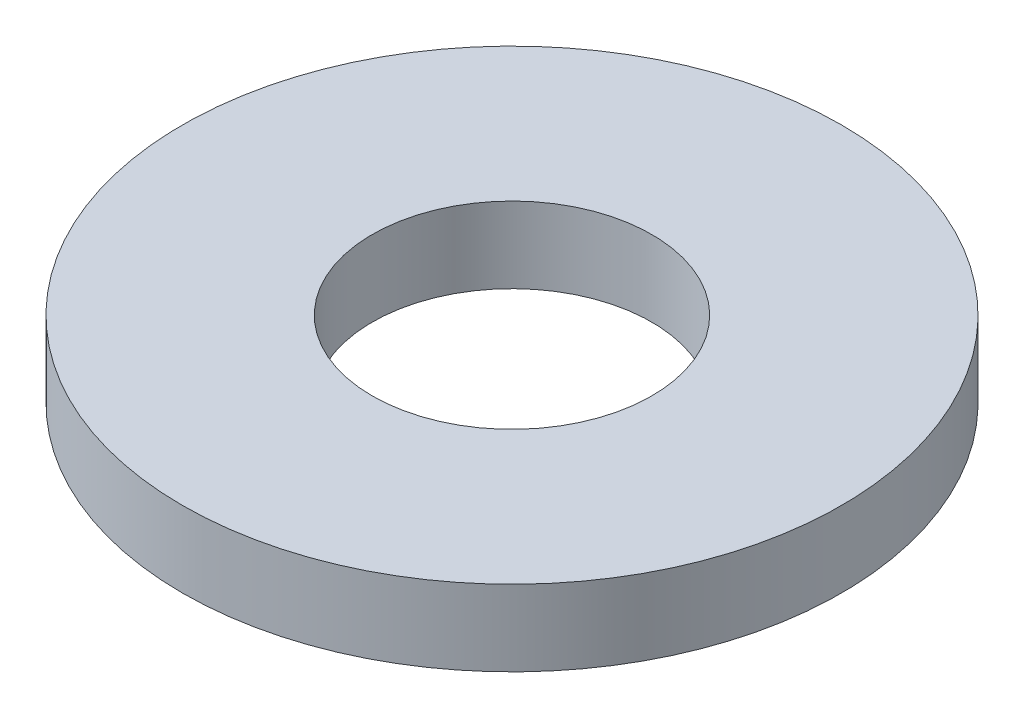
ISO-10303-21;
HEADER;
FILE_DESCRIPTION(('STEP AP214'),'2;1');
FILE_NAME('part.step','',(''),(''),'','','');
FILE_SCHEMA(('AUTOMOTIVE_DESIGN { 1 0 10303 214 1 1 1 1 }'));
ENDSEC;
DATA;
#1=APPLICATION_CONTEXT('core data for automotive mechanical design processes');
#2=APPLICATION_PROTOCOL_DEFINITION('international standard','automotive_design',2000,#1);
#3=PRODUCT_CONTEXT('',#1,'mechanical');
#4=PRODUCT('Part','Part','',(#3));
#5=PRODUCT_RELATED_PRODUCT_CATEGORY('part','',(#4));
#6=PRODUCT_DEFINITION_FORMATION('','',#4);
#7=PRODUCT_DEFINITION_CONTEXT('part definition',#1,'design');
#8=PRODUCT_DEFINITION('design','',#6,#7);
#9=PRODUCT_DEFINITION_SHAPE('','',#8);
#10=(LENGTH_UNIT() NAMED_UNIT(*) SI_UNIT(.MILLI.,.METRE.));
#11=(NAMED_UNIT(*) PLANE_ANGLE_UNIT() SI_UNIT($,.RADIAN.));
#12=(NAMED_UNIT(*) SI_UNIT($,.STERADIAN.) SOLID_ANGLE_UNIT());
#13=UNCERTAINTY_MEASURE_WITH_UNIT(LENGTH_MEASURE(1.E-05),#10,'distance_accuracy_value','');
#14=(GEOMETRIC_REPRESENTATION_CONTEXT(3) GLOBAL_UNCERTAINTY_ASSIGNED_CONTEXT((#13)) GLOBAL_UNIT_ASSIGNED_CONTEXT((#10,
#11,#12)) REPRESENTATION_CONTEXT('',''));
#15=CARTESIAN_POINT('',(0.,0.,0.));
#16=DIRECTION('',(0.,0.,1.));
#17=DIRECTION('',(1.,0.,0.));
#18=AXIS2_PLACEMENT_3D('',#15,#16,#17);
#19=CARTESIAN_POINT('',(0.,19.,0.));
#20=DIRECTION('',(0.,-1.,0.));
#21=DIRECTION('',(0.,0.,-1.));
#22=AXIS2_PLACEMENT_3D('',#19,#20,#21);
#23=CYLINDRICAL_SURFACE('',#22,82.5);
#24=CARTESIAN_POINT('',(0.,19.,0.));
#25=DIRECTION('',(0.,1.,0.));
#26=DIRECTION('',(0.,0.,1.));
#27=AXIS2_PLACEMENT_3D('',#24,#25,#26);
#28=CIRCLE('',#27,82.5);
#29=CARTESIAN_POINT('',(0.,19.,82.5));
#30=VERTEX_POINT('',#29);
#31=EDGE_CURVE('E10',#30,#30,#28,.T.);
#32=ORIENTED_EDGE('',*,*,#31,.F.);
#33=EDGE_LOOP('',(#32));
#34=FACE_BOUND('',#33,.T.);
#35=CARTESIAN_POINT('',(0.,0.,0.));
#36=DIRECTION('',(0.,1.,0.));
#37=DIRECTION('',(0.,0.,1.));
#38=AXIS2_PLACEMENT_3D('',#35,#36,#37);
#39=CIRCLE('',#38,82.5);
#40=CARTESIAN_POINT('',(0.,0.,82.5));
#41=VERTEX_POINT('',#40);
#42=EDGE_CURVE('E37',#41,#41,#39,.T.);
#43=ORIENTED_EDGE('',*,*,#42,.T.);
#44=EDGE_LOOP('',(#43));
#45=FACE_BOUND('',#44,.T.);
#46=ADVANCED_FACE('F40',(#34,#45),#23,.T.);
#47=CARTESIAN_POINT('',(0.,19.,0.));
#48=DIRECTION('',(0.,1.,0.));
#49=DIRECTION('',(0.,0.,1.));
#50=AXIS2_PLACEMENT_3D('',#47,#48,#49);
#51=PLANE('',#50);
#52=CARTESIAN_POINT('',(0.,19.,0.));
#53=DIRECTION('',(0.,1.,0.));
#54=DIRECTION('',(0.,0.,1.));
#55=AXIS2_PLACEMENT_3D('',#52,#53,#54);
#56=CIRCLE('',#55,35.);
#57=CARTESIAN_POINT('',(0.,19.,35.));
#58=VERTEX_POINT('',#57);
#59=EDGE_CURVE('E50',#58,#58,#56,.T.);
#60=ORIENTED_EDGE('',*,*,#59,.F.);
#61=EDGE_LOOP('',(#60));
#62=FACE_BOUND('',#61,.T.);
#63=ORIENTED_EDGE('',*,*,#31,.T.);
#64=EDGE_LOOP('',(#63));
#65=FACE_BOUND('',#64,.T.);
#66=ADVANCED_FACE('F59',(#62,#65),#51,.T.);
#67=CARTESIAN_POINT('',(0.,0.,0.));
#68=DIRECTION('',(0.,1.,0.));
#69=DIRECTION('',(0.,0.,1.));
#70=AXIS2_PLACEMENT_3D('',#67,#68,#69);
#71=PLANE('',#70);
#72=CARTESIAN_POINT('',(0.,0.,0.));
#73=DIRECTION('',(0.,1.,0.));
#74=DIRECTION('',(0.,0.,1.));
#75=AXIS2_PLACEMENT_3D('',#72,#73,#74);
#76=CIRCLE('',#75,35.);
#77=CARTESIAN_POINT('',(0.,0.,35.));
#78=VERTEX_POINT('',#77);
#79=EDGE_CURVE('E47',#78,#78,#76,.T.);
#80=ORIENTED_EDGE('',*,*,#79,.T.);
#81=EDGE_LOOP('',(#80));
#82=FACE_BOUND('',#81,.T.);
#83=ORIENTED_EDGE('',*,*,#42,.F.);
#84=EDGE_LOOP('',(#83));
#85=FACE_BOUND('',#84,.T.);
#86=ADVANCED_FACE('F58',(#82,#85),#71,.F.);
#87=CARTESIAN_POINT('',(0.,19.,0.));
#88=DIRECTION('',(0.,-1.,0.));
#89=DIRECTION('',(0.,0.,-1.));
#90=AXIS2_PLACEMENT_3D('',#87,#88,#89);
#91=CYLINDRICAL_SURFACE('',#90,35.);
#92=ORIENTED_EDGE('',*,*,#59,.T.);
#93=EDGE_LOOP('',(#92));
#94=FACE_BOUND('',#93,.T.);
#95=ORIENTED_EDGE('',*,*,#79,.F.);
#96=EDGE_LOOP('',(#95));
#97=FACE_BOUND('',#96,.T.);
#98=ADVANCED_FACE('F54',(#94,#97),#91,.F.);
#99=CLOSED_SHELL('',(#46,#66,#86,#98));
#100=MANIFOLD_SOLID_BREP('B2',#99);
#101=ADVANCED_BREP_SHAPE_REPRESENTATION('',(#18,#100),#14);
#102=SHAPE_DEFINITION_REPRESENTATION(#9,#101);
ENDSEC;
END-ISO-10303-21;
